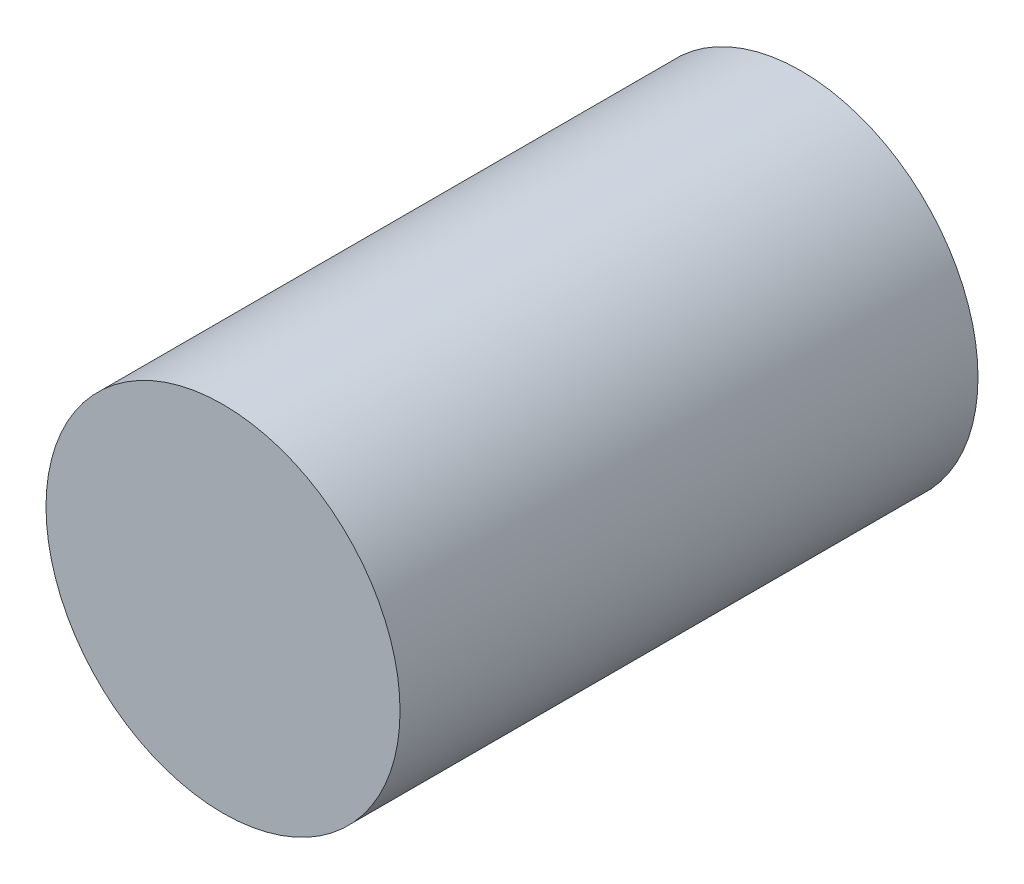
ISO-10303-21;
HEADER;
FILE_DESCRIPTION(('STEP AP214'),'2;1');
FILE_NAME('part.step','',(''),(''),'','','');
FILE_SCHEMA(('AUTOMOTIVE_DESIGN { 1 0 10303 214 1 1 1 1 }'));
ENDSEC;
DATA;
#1=APPLICATION_CONTEXT('core data for automotive mechanical design processes');
#2=APPLICATION_PROTOCOL_DEFINITION('international standard','automotive_design',2000,#1);
#3=PRODUCT_CONTEXT('',#1,'mechanical');
#4=PRODUCT('Part','Part','',(#3));
#5=PRODUCT_RELATED_PRODUCT_CATEGORY('part','',(#4));
#6=PRODUCT_DEFINITION_FORMATION('','',#4);
#7=PRODUCT_DEFINITION_CONTEXT('part definition',#1,'design');
#8=PRODUCT_DEFINITION('design','',#6,#7);
#9=PRODUCT_DEFINITION_SHAPE('','',#8);
#10=(LENGTH_UNIT() NAMED_UNIT(*) SI_UNIT(.MILLI.,.METRE.));
#11=(NAMED_UNIT(*) PLANE_ANGLE_UNIT() SI_UNIT($,.RADIAN.));
#12=(NAMED_UNIT(*) SI_UNIT($,.STERADIAN.) SOLID_ANGLE_UNIT());
#13=UNCERTAINTY_MEASURE_WITH_UNIT(LENGTH_MEASURE(1.E-05),#10,'distance_accuracy_value','');
#14=(GEOMETRIC_REPRESENTATION_CONTEXT(3) GLOBAL_UNCERTAINTY_ASSIGNED_CONTEXT((#13)) GLOBAL_UNIT_ASSIGNED_CONTEXT((#10,
#11,#12)) REPRESENTATION_CONTEXT('',''));
#15=CARTESIAN_POINT('',(0.,0.,0.));
#16=DIRECTION('',(0.,0.,1.));
#17=DIRECTION('',(1.,0.,0.));
#18=AXIS2_PLACEMENT_3D('',#15,#16,#17);
#19=CARTESIAN_POINT('',(15.,15.,-14.5271492664673));
#20=DIRECTION('',(0.,0.,1.));
#21=DIRECTION('',(1.,0.,0.));
#22=AXIS2_PLACEMENT_3D('',#19,#20,#21);
#23=CYLINDRICAL_SURFACE('',#22,6.425);
#24=CARTESIAN_POINT('',(15.,15.,-14.5271492664673));
#25=DIRECTION('',(0.,0.,1.));
#26=DIRECTION('',(1.,0.,0.));
#27=AXIS2_PLACEMENT_3D('',#24,#25,#26);
#28=CIRCLE('',#27,6.425);
#29=CARTESIAN_POINT('',(21.425,15.,-14.5271492664673));
#30=VERTEX_POINT('',#29);
#31=EDGE_CURVE('E10',#30,#30,#28,.T.);
#32=ORIENTED_EDGE('',*,*,#31,.T.);
#33=EDGE_LOOP('',(#32));
#34=FACE_BOUND('',#33,.T.);
#35=CARTESIAN_POINT('',(15.,15.,6.45));
#36=DIRECTION('',(0.,0.,1.));
#37=DIRECTION('',(1.,0.,0.));
#38=AXIS2_PLACEMENT_3D('',#35,#36,#37);
#39=CIRCLE('',#38,6.425);
#40=CARTESIAN_POINT('',(21.425,15.,6.45));
#41=VERTEX_POINT('',#40);
#42=EDGE_CURVE('E37',#41,#41,#39,.T.);
#43=ORIENTED_EDGE('',*,*,#42,.F.);
#44=EDGE_LOOP('',(#43));
#45=FACE_BOUND('',#44,.T.);
#46=ADVANCED_FACE('F31',(#34,#45),#23,.T.);
#47=CARTESIAN_POINT('',(15.,15.,-14.5271492664673));
#48=DIRECTION('',(0.,0.,1.));
#49=DIRECTION('',(1.,0.,0.));
#50=AXIS2_PLACEMENT_3D('',#47,#48,#49);
#51=PLANE('',#50);
#52=ORIENTED_EDGE('',*,*,#31,.F.);
#53=EDGE_LOOP('',(#52));
#54=FACE_BOUND('',#53,.T.);
#55=ADVANCED_FACE('F46',(#54),#51,.F.);
#56=CARTESIAN_POINT('',(15.,15.,6.45));
#57=DIRECTION('',(0.,0.,1.));
#58=DIRECTION('',(1.,0.,0.));
#59=AXIS2_PLACEMENT_3D('',#56,#57,#58);
#60=PLANE('',#59);
#61=ORIENTED_EDGE('',*,*,#42,.T.);
#62=EDGE_LOOP('',(#61));
#63=FACE_BOUND('',#62,.T.);
#64=ADVANCED_FACE('F43',(#63),#60,.T.);
#65=CLOSED_SHELL('',(#46,#55,#64));
#66=MANIFOLD_SOLID_BREP('B2',#65);
#67=ADVANCED_BREP_SHAPE_REPRESENTATION('',(#18,#66),#14);
#68=SHAPE_DEFINITION_REPRESENTATION(#9,#67);
ENDSEC;
END-ISO-10303-21;
